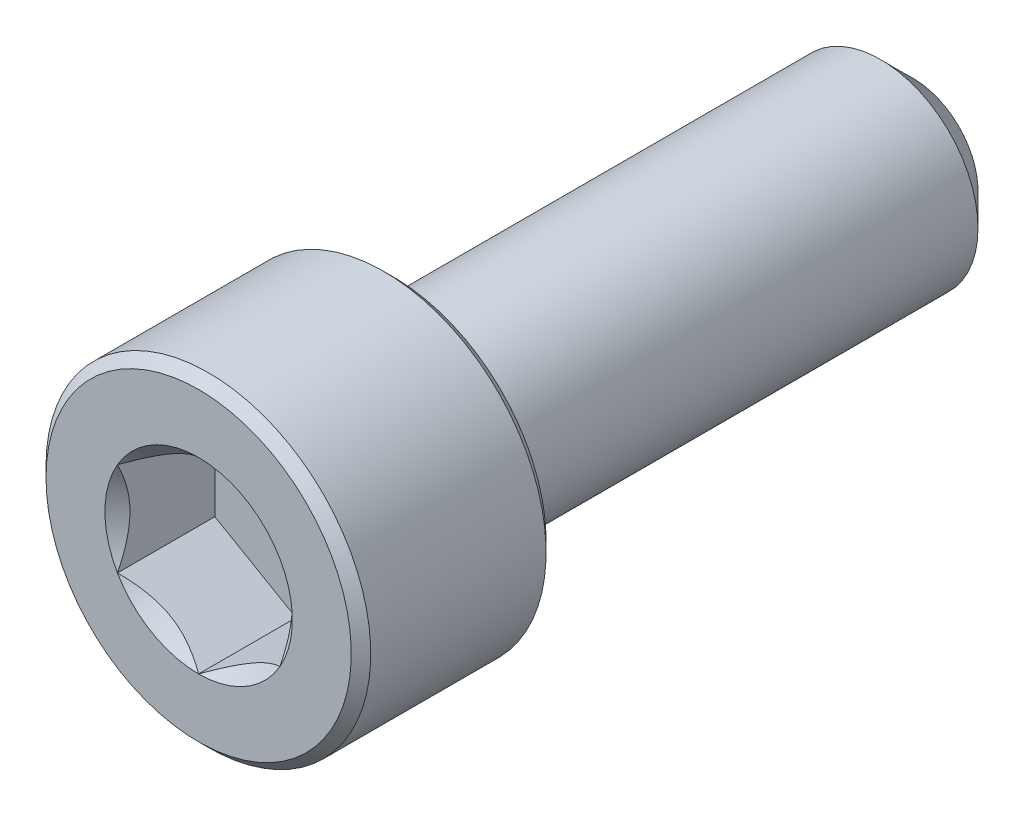
ISO-10303-21;
HEADER;
FILE_DESCRIPTION(('STEP AP214'),'2;1');
FILE_NAME('part.step','',(''),(''),'','','');
FILE_SCHEMA(('AUTOMOTIVE_DESIGN { 1 0 10303 214 1 1 1 1 }'));
ENDSEC;
DATA;
#1=APPLICATION_CONTEXT('core data for automotive mechanical design processes');
#2=APPLICATION_PROTOCOL_DEFINITION('international standard','automotive_design',2000,#1);
#3=PRODUCT_CONTEXT('',#1,'mechanical');
#4=PRODUCT('Part','Part','',(#3));
#5=PRODUCT_RELATED_PRODUCT_CATEGORY('part','',(#4));
#6=PRODUCT_DEFINITION_FORMATION('','',#4);
#7=PRODUCT_DEFINITION_CONTEXT('part definition',#1,'design');
#8=PRODUCT_DEFINITION('design','',#6,#7);
#9=PRODUCT_DEFINITION_SHAPE('','',#8);
#10=(LENGTH_UNIT() NAMED_UNIT(*) SI_UNIT(.MILLI.,.METRE.));
#11=(NAMED_UNIT(*) PLANE_ANGLE_UNIT() SI_UNIT($,.RADIAN.));
#12=(NAMED_UNIT(*) SI_UNIT($,.STERADIAN.) SOLID_ANGLE_UNIT());
#13=UNCERTAINTY_MEASURE_WITH_UNIT(LENGTH_MEASURE(1.E-05),#10,'distance_accuracy_value','');
#14=(GEOMETRIC_REPRESENTATION_CONTEXT(3) GLOBAL_UNCERTAINTY_ASSIGNED_CONTEXT((#13)) GLOBAL_UNIT_ASSIGNED_CONTEXT((#10,
#11,#12)) REPRESENTATION_CONTEXT('',''));
#15=CARTESIAN_POINT('',(0.,0.,0.));
#16=DIRECTION('',(0.,0.,1.));
#17=DIRECTION('',(1.,0.,0.));
#18=AXIS2_PLACEMENT_3D('',#15,#16,#17);
#19=CARTESIAN_POINT('',(0.,4.7,11.));
#20=DIRECTION('',(0.,0.,1.));
#21=DIRECTION('',(1.,0.,0.));
#22=AXIS2_PLACEMENT_3D('',#19,#20,#21);
#23=PLANE('',#22);
#24=CARTESIAN_POINT('',(0.,0.,11.));
#25=DIRECTION('',(0.,0.,1.));
#26=DIRECTION('',(1.,0.,0.));
#27=AXIS2_PLACEMENT_3D('',#24,#25,#26);
#28=CIRCLE('',#27,2.88675134594813);
#29=CARTESIAN_POINT('',(2.5,1.44337567297407,11.));
#30=VERTEX_POINT('',#29);
#31=CARTESIAN_POINT('',(0.,2.88675134594813,11.));
#32=VERTEX_POINT('',#31);
#33=EDGE_CURVE('E98',#30,#32,#28,.T.);
#34=ORIENTED_EDGE('',*,*,#33,.F.);
#35=CARTESIAN_POINT('',(2.5,-1.44337567297407,11.));
#36=VERTEX_POINT('',#35);
#37=EDGE_CURVE('E58',#36,#30,#28,.T.);
#38=ORIENTED_EDGE('',*,*,#37,.F.);
#39=CARTESIAN_POINT('',(0.,-2.88675134594813,11.));
#40=VERTEX_POINT('',#39);
#41=EDGE_CURVE('E284',#40,#36,#28,.T.);
#42=ORIENTED_EDGE('',*,*,#41,.F.);
#43=CARTESIAN_POINT('',(-2.5,-1.44337567297406,11.));
#44=VERTEX_POINT('',#43);
#45=EDGE_CURVE('E65',#44,#40,#28,.T.);
#46=ORIENTED_EDGE('',*,*,#45,.F.);
#47=CARTESIAN_POINT('',(-2.5,1.44337567297407,11.));
#48=VERTEX_POINT('',#47);
#49=EDGE_CURVE('E134',#48,#44,#28,.T.);
#50=ORIENTED_EDGE('',*,*,#49,.F.);
#51=EDGE_CURVE('E107',#32,#48,#28,.T.);
#52=ORIENTED_EDGE('',*,*,#51,.F.);
#53=EDGE_LOOP('',(#34,#38,#42,#46,#50,#52));
#54=FACE_BOUND('',#53,.T.);
#55=CARTESIAN_POINT('',(0.,0.,11.));
#56=DIRECTION('',(0.,0.,-1.));
#57=DIRECTION('',(-1.,0.,0.));
#58=AXIS2_PLACEMENT_3D('',#55,#56,#57);
#59=CIRCLE('',#58,4.7);
#60=CARTESIAN_POINT('',(-4.7,0.,11.));
#61=VERTEX_POINT('',#60);
#62=EDGE_CURVE('E52',#61,#61,#59,.T.);
#63=ORIENTED_EDGE('',*,*,#62,.F.);
#64=EDGE_LOOP('',(#63));
#65=FACE_BOUND('',#64,.T.);
#66=ADVANCED_FACE('F39',(#54,#65),#23,.T.);
#67=CARTESIAN_POINT('',(0.,0.,10.7));
#68=DIRECTION('',(0.,0.,-1.));
#69=DIRECTION('',(-1.,0.,0.));
#70=AXIS2_PLACEMENT_3D('',#67,#68,#69);
#71=CONICAL_SURFACE('',#70,5.,0.785398163397445);
#72=ORIENTED_EDGE('',*,*,#62,.T.);
#73=EDGE_LOOP('',(#72));
#74=FACE_BOUND('',#73,.T.);
#75=CARTESIAN_POINT('',(0.,0.,10.7));
#76=DIRECTION('',(0.,0.,-1.));
#77=DIRECTION('',(-1.,0.,0.));
#78=AXIS2_PLACEMENT_3D('',#75,#76,#77);
#79=CIRCLE('',#78,5.);
#80=CARTESIAN_POINT('',(-5.,0.,10.7));
#81=VERTEX_POINT('',#80);
#82=EDGE_CURVE('E218',#81,#81,#79,.T.);
#83=ORIENTED_EDGE('',*,*,#82,.F.);
#84=EDGE_LOOP('',(#83));
#85=FACE_BOUND('',#84,.T.);
#86=ADVANCED_FACE('F223',(#74,#85),#71,.T.);
#87=CARTESIAN_POINT('',(0.,0.,-11.));
#88=DIRECTION('',(0.,0.,-1.));
#89=DIRECTION('',(-1.,0.,0.));
#90=AXIS2_PLACEMENT_3D('',#87,#88,#89);
#91=CYLINDRICAL_SURFACE('',#90,5.);
#92=ORIENTED_EDGE('',*,*,#82,.T.);
#93=EDGE_LOOP('',(#92));
#94=FACE_BOUND('',#93,.T.);
#95=CARTESIAN_POINT('',(0.,0.,5.3));
#96=DIRECTION('',(0.,0.,-1.));
#97=DIRECTION('',(-1.,0.,0.));
#98=AXIS2_PLACEMENT_3D('',#95,#96,#97);
#99=CIRCLE('',#98,5.);
#100=CARTESIAN_POINT('',(-5.,0.,5.3));
#101=VERTEX_POINT('',#100);
#102=EDGE_CURVE('E215',#101,#101,#99,.T.);
#103=ORIENTED_EDGE('',*,*,#102,.F.);
#104=EDGE_LOOP('',(#103));
#105=FACE_BOUND('',#104,.T.);
#106=ADVANCED_FACE('F229',(#94,#105),#91,.T.);
#107=CARTESIAN_POINT('',(0.,0.,5.));
#108=DIRECTION('',(0.,0.,1.));
#109=DIRECTION('',(1.,0.,0.));
#110=AXIS2_PLACEMENT_3D('',#107,#108,#109);
#111=CONICAL_SURFACE('',#110,4.7,0.785398163397454);
#112=ORIENTED_EDGE('',*,*,#102,.T.);
#113=EDGE_LOOP('',(#112));
#114=FACE_BOUND('',#113,.T.);
#115=CARTESIAN_POINT('',(0.,0.,5.));
#116=DIRECTION('',(0.,0.,-1.));
#117=DIRECTION('',(-1.,0.,0.));
#118=AXIS2_PLACEMENT_3D('',#115,#116,#117);
#119=CIRCLE('',#118,4.7);
#120=CARTESIAN_POINT('',(-4.7,0.,5.));
#121=VERTEX_POINT('',#120);
#122=EDGE_CURVE('E212',#121,#121,#119,.T.);
#123=ORIENTED_EDGE('',*,*,#122,.F.);
#124=EDGE_LOOP('',(#123));
#125=FACE_BOUND('',#124,.T.);
#126=ADVANCED_FACE('F233',(#114,#125),#111,.T.);
#127=CARTESIAN_POINT('',(0.,4.7,5.));
#128=DIRECTION('',(0.,0.,-1.));
#129=DIRECTION('',(-1.,0.,0.));
#130=AXIS2_PLACEMENT_3D('',#127,#128,#129);
#131=PLANE('',#130);
#132=ORIENTED_EDGE('',*,*,#122,.T.);
#133=EDGE_LOOP('',(#132));
#134=FACE_BOUND('',#133,.T.);
#135=CARTESIAN_POINT('',(0.,0.,5.));
#136=DIRECTION('',(0.,0.,-1.));
#137=DIRECTION('',(-1.,0.,0.));
#138=AXIS2_PLACEMENT_3D('',#135,#136,#137);
#139=CIRCLE('',#138,3.);
#140=CARTESIAN_POINT('',(-3.,0.,5.));
#141=VERTEX_POINT('',#140);
#142=EDGE_CURVE('E209',#141,#141,#139,.T.);
#143=ORIENTED_EDGE('',*,*,#142,.F.);
#144=EDGE_LOOP('',(#143));
#145=FACE_BOUND('',#144,.T.);
#146=ADVANCED_FACE('F239',(#134,#145),#131,.T.);
#147=CARTESIAN_POINT('',(0.,0.,-11.));
#148=DIRECTION('',(0.,0.,-1.));
#149=DIRECTION('',(-1.,0.,0.));
#150=AXIS2_PLACEMENT_3D('',#147,#148,#149);
#151=CYLINDRICAL_SURFACE('',#150,3.);
#152=ORIENTED_EDGE('',*,*,#142,.T.);
#153=EDGE_LOOP('',(#152));
#154=FACE_BOUND('',#153,.T.);
#155=CARTESIAN_POINT('',(0.,0.,-9.99999999999999));
#156=DIRECTION('',(0.,0.,-1.));
#157=DIRECTION('',(-1.,0.,0.));
#158=AXIS2_PLACEMENT_3D('',#155,#156,#157);
#159=CIRCLE('',#158,3.);
#160=CARTESIAN_POINT('',(-3.,0.,-9.99999999999999));
#161=VERTEX_POINT('',#160);
#162=EDGE_CURVE('E206',#161,#161,#159,.T.);
#163=ORIENTED_EDGE('',*,*,#162,.F.);
#164=EDGE_LOOP('',(#163));
#165=FACE_BOUND('',#164,.T.);
#166=ADVANCED_FACE('F243',(#154,#165),#151,.T.);
#167=CARTESIAN_POINT('',(0.,0.,-11.));
#168=DIRECTION('',(0.,0.,1.));
#169=DIRECTION('',(1.,0.,0.));
#170=AXIS2_PLACEMENT_3D('',#167,#168,#169);
#171=CONICAL_SURFACE('',#170,2.,0.785398163397443);
#172=ORIENTED_EDGE('',*,*,#162,.T.);
#173=EDGE_LOOP('',(#172));
#174=FACE_BOUND('',#173,.T.);
#175=CARTESIAN_POINT('',(0.,0.,-11.));
#176=DIRECTION('',(0.,0.,-1.));
#177=DIRECTION('',(-1.,0.,0.));
#178=AXIS2_PLACEMENT_3D('',#175,#176,#177);
#179=CIRCLE('',#178,2.);
#180=CARTESIAN_POINT('',(-2.,0.,-11.));
#181=VERTEX_POINT('',#180);
#182=EDGE_CURVE('E194',#181,#181,#179,.T.);
#183=ORIENTED_EDGE('',*,*,#182,.F.);
#184=EDGE_LOOP('',(#183));
#185=FACE_BOUND('',#184,.T.);
#186=ADVANCED_FACE('F246',(#174,#185),#171,.T.);
#187=CARTESIAN_POINT('',(0.,2.,-11.));
#188=DIRECTION('',(0.,0.,-1.));
#189=DIRECTION('',(-1.,0.,0.));
#190=AXIS2_PLACEMENT_3D('',#187,#188,#189);
#191=PLANE('',#190);
#192=ORIENTED_EDGE('',*,*,#182,.T.);
#193=EDGE_LOOP('',(#192));
#194=FACE_BOUND('',#193,.T.);
#195=ADVANCED_FACE('F167',(#194),#191,.T.);
#196=CARTESIAN_POINT('',(0.,0.,11.));
#197=DIRECTION('',(0.,0.,1.));
#198=DIRECTION('',(1.,0.,0.));
#199=AXIS2_PLACEMENT_3D('',#196,#197,#198);
#200=CONICAL_SURFACE('',#199,2.88675134594813,0.78539816339745);
#201=ORIENTED_EDGE('',*,*,#51,.T.);
#202=CARTESIAN_POINT('',(0.00020000000000054,2.88686681600197,11.0001154769818));
#203=CARTESIAN_POINT('',(-0.0857382777877643,2.83725032818751,10.9505407053547));
#204=CARTESIAN_POINT('',(-0.173113567275753,2.7868041812811,10.9038774813625));
#205=CARTESIAN_POINT('',(-0.351281456165588,2.6839389026696,10.8184381400383));
#206=CARTESIAN_POINT('',(-0.442091000681074,2.6315099876986,10.779709562406));
#207=CARTESIAN_POINT('',(-0.625204123126921,2.52578957716234,10.7133667038977));
#208=CARTESIAN_POINT('',(-0.71746106452934,2.47252500720904,10.6855856685309));
#209=CARTESIAN_POINT('',(-0.904006008776286,2.3648232334321,10.6427831759107));
#210=CARTESIAN_POINT('',(-0.998288312566283,2.31038931995913,10.6277297666713));
#211=CARTESIAN_POINT('',(-1.16077825829185,2.21657570605387,10.6141477222095));
#212=CARTESIAN_POINT('',(-1.22877596788015,2.17731721011878,10.6121370992408));
#213=CARTESIAN_POINT('',(-1.36466024116922,2.0988643883567,10.6155241171875));
#214=CARTESIAN_POINT('',(-1.43254675755224,2.05967008984862,10.6209243552998));
#215=CARTESIAN_POINT('',(-1.56767878823611,1.98165157555715,10.6388257884025));
#216=CARTESIAN_POINT('',(-1.63492349975356,1.94282782326097,10.6513349270465));
#217=CARTESIAN_POINT('',(-1.7682501008182,1.86585167424616,10.6827675019557));
#218=CARTESIAN_POINT('',(-1.83433207909966,1.82769922629678,10.7016904464968));
#219=CARTESIAN_POINT('',(-2.00359634669126,1.72997445583858,10.7578673614082));
#220=CARTESIAN_POINT('',(-2.10572912222289,1.67100807039231,10.7993558315962));
#221=CARTESIAN_POINT('',(-2.25590641494051,1.58430317001562,10.8693940467231));
#222=CARTESIAN_POINT('',(-2.30539653988261,1.55573003305807,10.8940022521161));
#223=CARTESIAN_POINT('',(-2.40346006383885,1.49911303110426,10.9454618867152));
#224=CARTESIAN_POINT('',(-2.45203400349693,1.47106885396706,10.9723119387794));
#225=CARTESIAN_POINT('',(-2.5002,1.44326020292023,11.0001154769818));
#226=B_SPLINE_CURVE_WITH_KNOTS('',3,(#202,#203,#204,#205,#206,#207,#208,#209,#210,#211,#212,
#213,#214,#215,#216,#217,#218,#219,#220,#221,#222,#223,#224,#225),.UNSPECIFIED.,.F.,.F.,(4,2,2,
2,2,2,2,2,2,2,2,4),(0.,0.333012085133924,0.667964518301397,0.997597032043299,1.32639954393844,
1.56169424147169,1.79707142102083,2.03271213522171,2.26833478775651,2.64260240809533,
2.82922877818864,3.01574133749025),.UNSPECIFIED.);
#227=EDGE_CURVE('E11',#32,#48,#226,.T.);
#228=ORIENTED_EDGE('',*,*,#227,.F.);
#229=EDGE_LOOP('',(#201,#228));
#230=FACE_BOUND('',#229,.T.);
#231=ADVANCED_FACE('F111',(#230),#200,.F.);
#232=ORIENTED_EDGE('',*,*,#49,.T.);
#233=CARTESIAN_POINT('',(-2.5,-2.96668433955212,11.9928383192799));
#234=CARTESIAN_POINT('',(-2.5,-2.89483170967249,11.9379057089797));
#235=CARTESIAN_POINT('',(-2.5,-2.82258679707705,11.883478050823));
#236=CARTESIAN_POINT('',(-2.5,-2.67715393829105,11.7758617915343));
#237=CARTESIAN_POINT('',(-2.5,-2.60396576868743,11.7226734926472));
#238=CARTESIAN_POINT('',(-2.5,-2.45595268046653,11.6173865397426));
#239=CARTESIAN_POINT('',(-2.5,-2.38111948346966,11.5652994850005));
#240=CARTESIAN_POINT('',(-2.5,-2.23019896534479,11.4629812536341));
#241=CARTESIAN_POINT('',(-2.5,-2.15411173180743,11.4127499481792));
#242=CARTESIAN_POINT('',(-2.5,-1.99575761371829,11.311547152196));
#243=CARTESIAN_POINT('',(-2.5,-1.91339821044008,11.2607196975498));
#244=CARTESIAN_POINT('',(-2.5,-1.74677292530007,11.1622970160088));
#245=CARTESIAN_POINT('',(-2.5,-1.6625072948511,11.1147013661458));
#246=CARTESIAN_POINT('',(-2.5,-1.49202090628761,11.0237370895292));
#247=CARTESIAN_POINT('',(-2.5,-1.4058065139511,10.9803566253319));
#248=CARTESIAN_POINT('',(-2.5,-1.23096887512707,10.8988023964179));
#249=CARTESIAN_POINT('',(-2.5,-1.14234677306193,10.8606262082116));
#250=CARTESIAN_POINT('',(-2.5,-0.970857842618475,10.7940912240297));
#251=CARTESIAN_POINT('',(-2.5,-0.88821917035142,10.7651503854592));
#252=CARTESIAN_POINT('',(-2.5,-0.72087529812657,10.7138877367376));
#253=CARTESIAN_POINT('',(-2.5,-0.636169963529765,10.6915663590842));
#254=CARTESIAN_POINT('',(-2.5,-0.466650942448522,10.6551078210399));
#255=CARTESIAN_POINT('',(-2.5,-0.381869134653475,10.640824902214));
#256=CARTESIAN_POINT('',(-2.5,-0.21130174226405,10.6207346384147));
#257=CARTESIAN_POINT('',(-2.5,-0.125516356521813,10.6149256421311));
#258=CARTESIAN_POINT('',(-2.5,0.0426703656744088,10.6122567453414));
#259=CARTESIAN_POINT('',(-2.5,0.125066107632579,10.6150393831091));
#260=CARTESIAN_POINT('',(-2.5,0.289193381610074,10.6285896677016));
#261=CARTESIAN_POINT('',(-2.5,0.370924851074764,10.6393580579361));
#262=CARTESIAN_POINT('',(-2.5,0.534518605306861,10.668460488394));
#263=CARTESIAN_POINT('',(-2.5,0.616357066153053,10.6869264467587));
#264=CARTESIAN_POINT('',(-2.5,0.778230408567295,10.7304160931401));
#265=CARTESIAN_POINT('',(-2.5,0.858265409015189,10.7554393475341));
#266=CARTESIAN_POINT('',(-2.5,1.1064014205137,10.8425323271403));
#267=CARTESIAN_POINT('',(-2.5,1.27108970475709,10.9143583169891));
#268=CARTESIAN_POINT('',(-2.5,1.51211013995078,11.0341428940312));
#269=CARTESIAN_POINT('',(-2.5,1.59159684007468,11.0761721404265));
#270=CARTESIAN_POINT('',(-2.5,1.74876895904321,11.1634810506814));
#271=CARTESIAN_POINT('',(-2.5,1.82645469386738,11.2087601385578));
#272=CARTESIAN_POINT('',(-2.5,1.97643122124165,11.2996104452916));
#273=CARTESIAN_POINT('',(-2.5,2.04879877304287,11.3450563815238));
#274=CARTESIAN_POINT('',(-2.5,2.19229239644038,11.4378770245958));
#275=CARTESIAN_POINT('',(-2.5,2.2634183740633,11.4852518765365));
#276=CARTESIAN_POINT('',(-2.5,2.4040160675888,11.5811974908952));
#277=CARTESIAN_POINT('',(-2.5,2.47349649538701,11.6297555399303));
#278=CARTESIAN_POINT('',(-2.5,2.61150521882323,11.7281681623755));
#279=CARTESIAN_POINT('',(-2.5,2.68003377150943,11.7780223748942));
#280=CARTESIAN_POINT('',(-2.5,2.74816343524431,11.8284070984273));
#281=B_SPLINE_CURVE_WITH_KNOTS('',3,(#233,#234,#235,#236,#237,#238,#239,#240,#241,#242,#243,
#244,#245,#246,#247,#248,#249,#250,#251,#252,#253,#254,#255,#256,#257,#258,#259,#260,#261,#262,
#263,#264,#265,#266,#267,#268,#269,#270,#271,#272,#273,#274,#275,#276,#277,#278,#279,#280),
.UNSPECIFIED.,.F.,.F.,(4,2,2,2,2,2,2,2,2,2,2,2,2,2,2,2,2,2,2,2,2,2,2,4),(0.,0.271341667855832,
0.542748830046722,0.816253709161613,1.08973956507594,1.38002315639178,1.67026868280412,
1.959674013636,2.24894411253435,2.51139576932094,2.77386457021756,3.0314066607157,
3.28889855737335,3.53582375183444,3.78277193594475,4.03413854269895,4.28548853120069,
4.82282938730673,5.09254998785807,5.36222290216636,5.61855395261544,5.87490432107987,
6.12918893681205,6.38340349453406),.UNSPECIFIED.);
#282=EDGE_CURVE('E106',#48,#44,#281,.F.);
#283=ORIENTED_EDGE('',*,*,#282,.F.);
#284=EDGE_LOOP('',(#232,#283));
#285=FACE_BOUND('',#284,.T.);
#286=ADVANCED_FACE('F261',(#285),#200,.F.);
#287=ORIENTED_EDGE('',*,*,#45,.T.);
#288=CARTESIAN_POINT('',(-2.5002,-1.44326020292023,11.0001154769818));
#289=CARTESIAN_POINT('',(-2.41426172221224,-1.49287669073469,10.9505407053547));
#290=CARTESIAN_POINT('',(-2.32688643272425,-1.5433228376411,10.9038774813625));
#291=CARTESIAN_POINT('',(-2.14871854383441,-1.64618811625259,10.8184381400383));
#292=CARTESIAN_POINT('',(-2.05790899931893,-1.69861703122359,10.779709562406));
#293=CARTESIAN_POINT('',(-1.87479587687308,-1.80433744175986,10.7133667038977));
#294=CARTESIAN_POINT('',(-1.78253893547066,-1.85760201171315,10.6855856685309));
#295=CARTESIAN_POINT('',(-1.59599399122372,-1.96530378549009,10.6427831759107));
#296=CARTESIAN_POINT('',(-1.50171168743372,-2.01973769896307,10.6277297666713));
#297=CARTESIAN_POINT('',(-1.33922174170816,-2.11355131286833,10.6141477222095));
#298=CARTESIAN_POINT('',(-1.27122403211985,-2.15280980880341,10.6121370992408));
#299=CARTESIAN_POINT('',(-1.13533975883078,-2.23126263056549,10.6155241171875));
#300=CARTESIAN_POINT('',(-1.06745324244776,-2.27045692907358,10.6209243552998));
#301=CARTESIAN_POINT('',(-0.932321211763895,-2.34847544336505,10.6388257884025));
#302=CARTESIAN_POINT('',(-0.865076500246441,-2.38729919566123,10.6513349270465));
#303=CARTESIAN_POINT('',(-0.731749899181802,-2.46427534467604,10.6827675019557));
#304=CARTESIAN_POINT('',(-0.665667920900344,-2.50242779262542,10.7016904464968));
#305=CARTESIAN_POINT('',(-0.496403653308736,-2.60015256308362,10.7578673614082));
#306=CARTESIAN_POINT('',(-0.394270877777108,-2.65911894852989,10.7993558315962));
#307=CARTESIAN_POINT('',(-0.244093585059492,-2.74582384890657,10.8693940467231));
#308=CARTESIAN_POINT('',(-0.194603460117392,-2.77439698586412,10.8940022521161));
#309=CARTESIAN_POINT('',(-0.0965399361611542,-2.83101398781794,10.9454618867152));
#310=CARTESIAN_POINT('',(-0.047965996503073,-2.85905816495513,10.9723119387794));
#311=CARTESIAN_POINT('',(0.000199999999999232,-2.88686681600197,11.0001154769818));
#312=B_SPLINE_CURVE_WITH_KNOTS('',3,(#288,#289,#290,#291,#292,#293,#294,#295,#296,#297,#298,
#299,#300,#301,#302,#303,#304,#305,#306,#307,#308,#309,#310,#311),.UNSPECIFIED.,.F.,.F.,(4,2,2,
2,2,2,2,2,2,2,2,4),(0.,0.333012085133923,0.667964518301397,0.997597032043299,1.32639954393844,
1.56169424147169,1.79707142102083,2.03271213522171,2.26833478775651,2.64260240809533,
2.82922877818864,3.01574133749025),.UNSPECIFIED.);
#313=EDGE_CURVE('E143',#44,#40,#312,.T.);
#314=ORIENTED_EDGE('',*,*,#313,.F.);
#315=EDGE_LOOP('',(#287,#314));
#316=FACE_BOUND('',#315,.T.);
#317=ADVANCED_FACE('F265',(#316),#200,.F.);
#318=ORIENTED_EDGE('',*,*,#41,.T.);
#319=CARTESIAN_POINT('',(-0.000200000000000439,-2.88686681600197,11.0001154769818));
#320=CARTESIAN_POINT('',(0.0857382777877645,-2.83725032818751,10.9505407053547));
#321=CARTESIAN_POINT('',(0.173113567275753,-2.7868041812811,10.9038774813625));
#322=CARTESIAN_POINT('',(0.351281456165588,-2.6839389026696,10.8184381400383));
#323=CARTESIAN_POINT('',(0.442091000681074,-2.6315099876986,10.779709562406));
#324=CARTESIAN_POINT('',(0.62520412312692,-2.52578957716234,10.7133667038977));
#325=CARTESIAN_POINT('',(0.71746106452934,-2.47252500720904,10.6855856685309));
#326=CARTESIAN_POINT('',(0.904006008776285,-2.3648232334321,10.6427831759107));
#327=CARTESIAN_POINT('',(0.998288312566282,-2.31038931995913,10.6277297666713));
#328=CARTESIAN_POINT('',(1.16077825829184,-2.21657570605387,10.6141477222095));
#329=CARTESIAN_POINT('',(1.22877596788015,-2.17731721011878,10.6121370992408));
#330=CARTESIAN_POINT('',(1.36466024116922,-2.0988643883567,10.6155241171875));
#331=CARTESIAN_POINT('',(1.43254675755224,-2.05967008984862,10.6209243552998));
#332=CARTESIAN_POINT('',(1.5676787882361,-1.98165157555715,10.6388257884025));
#333=CARTESIAN_POINT('',(1.63492349975356,-1.94282782326097,10.6513349270465));
#334=CARTESIAN_POINT('',(1.7682501008182,-1.86585167424616,10.6827675019557));
#335=CARTESIAN_POINT('',(1.83433207909966,-1.82769922629678,10.7016904464968));
#336=CARTESIAN_POINT('',(2.00359634669126,-1.72997445583858,10.7578673614082));
#337=CARTESIAN_POINT('',(2.10572912222289,-1.67100807039231,10.7993558315962));
#338=CARTESIAN_POINT('',(2.25590641494051,-1.58430317001562,10.8693940467231));
#339=CARTESIAN_POINT('',(2.30539653988261,-1.55573003305807,10.8940022521161));
#340=CARTESIAN_POINT('',(2.40346006383885,-1.49911303110426,10.9454618867152));
#341=CARTESIAN_POINT('',(2.45203400349693,-1.47106885396706,10.9723119387794));
#342=CARTESIAN_POINT('',(2.5002,-1.44326020292023,11.0001154769818));
#343=B_SPLINE_CURVE_WITH_KNOTS('',3,(#319,#320,#321,#322,#323,#324,#325,#326,#327,#328,#329,
#330,#331,#332,#333,#334,#335,#336,#337,#338,#339,#340,#341,#342),.UNSPECIFIED.,.F.,.F.,(4,2,2,
2,2,2,2,2,2,2,2,4),(0.,0.333012085133923,0.667964518301396,0.997597032043298,1.32639954393844,
1.56169424147168,1.79707142102083,2.0327121352217,2.2683347877565,2.64260240809533,
2.82922877818864,3.01574133749025),.UNSPECIFIED.);
#344=EDGE_CURVE('E286',#40,#36,#343,.T.);
#345=ORIENTED_EDGE('',*,*,#344,.F.);
#346=EDGE_LOOP('',(#318,#345));
#347=FACE_BOUND('',#346,.T.);
#348=ADVANCED_FACE('F274',(#347),#200,.F.);
#349=ORIENTED_EDGE('',*,*,#37,.T.);
#350=CARTESIAN_POINT('',(2.5,-2.96668433956992,11.9928383192935));
#351=CARTESIAN_POINT('',(2.5,-2.89483170968978,11.9379057089928));
#352=CARTESIAN_POINT('',(2.5,-2.82258679709383,11.8834780508356));
#353=CARTESIAN_POINT('',(2.5,-2.6771539383068,11.7758617915458));
#354=CARTESIAN_POINT('',(2.5,-2.60396576870266,11.7226734926582));
#355=CARTESIAN_POINT('',(2.5,-2.45595268048071,11.6173865397526));
#356=CARTESIAN_POINT('',(2.5,-2.38111948348331,11.5652994850099));
#357=CARTESIAN_POINT('',(2.5,-2.23019896535737,11.4629812536425));
#358=CARTESIAN_POINT('',(2.5,-2.15411173181947,11.4127499481871));
#359=CARTESIAN_POINT('',(2.5,-1.99575761372916,11.3115471522028));
#360=CARTESIAN_POINT('',(2.5,-1.91339821045031,11.260719697556));
#361=CARTESIAN_POINT('',(2.5,-1.74677292530902,11.1622970160139));
#362=CARTESIAN_POINT('',(2.5,-1.6625072948594,11.1147013661504));
#363=CARTESIAN_POINT('',(2.5,-1.49202090629459,11.0237370895328));
#364=CARTESIAN_POINT('',(2.5,-1.4058065139574,10.980356625335));
#365=CARTESIAN_POINT('',(2.5,-1.23096887513198,10.8988023964201));
#366=CARTESIAN_POINT('',(2.5,-1.14234677306614,10.8606262082134));
#367=CARTESIAN_POINT('',(2.5,-0.970857842622378,10.7940912240311));
#368=CARTESIAN_POINT('',(2.5,-0.888219170355766,10.7651503854607));
#369=CARTESIAN_POINT('',(2.5,-0.720875298131817,10.713887736739));
#370=CARTESIAN_POINT('',(2.5,-0.636169963535471,10.6915663590856));
#371=CARTESIAN_POINT('',(2.5,-0.466650942455131,10.6551078210411));
#372=CARTESIAN_POINT('',(2.5,-0.381869134660527,10.6408249022151));
#373=CARTESIAN_POINT('',(2.5,-0.211301742271978,10.6207346384154));
#374=CARTESIAN_POINT('',(2.5,-0.125516356530172,10.6149256421315));
#375=CARTESIAN_POINT('',(2.5,0.0426703656652953,10.6122567453413));
#376=CARTESIAN_POINT('',(2.5,0.125066107623141,10.6150393831087));
#377=CARTESIAN_POINT('',(2.5,0.289193381600021,10.6285896677004));
#378=CARTESIAN_POINT('',(2.5,0.370924851064421,10.6393580579346));
#379=CARTESIAN_POINT('',(2.5,0.534518605295946,10.6684604883917));
#380=CARTESIAN_POINT('',(2.5,0.616357066141858,10.686926446756));
#381=CARTESIAN_POINT('',(2.5,0.778230408555566,10.7304160931367));
#382=CARTESIAN_POINT('',(2.5,0.858265409003208,10.7554393475302));
#383=CARTESIAN_POINT('',(2.5,1.10640142049915,10.8425323271345));
#384=CARTESIAN_POINT('',(2.5,1.27108970474035,10.9143583169815));
#385=CARTESIAN_POINT('',(2.5,1.5121101399309,11.034142894021));
#386=CARTESIAN_POINT('',(2.5,1.59159684005377,11.0761721404153));
#387=CARTESIAN_POINT('',(2.5,1.74876895902027,11.1634810506683));
#388=CARTESIAN_POINT('',(2.5,1.82645469384344,11.2087601385437));
#389=CARTESIAN_POINT('',(2.5,1.9764312212159,11.2996104452756));
#390=CARTESIAN_POINT('',(2.5,2.0487987730163,11.345056381507));
#391=CARTESIAN_POINT('',(2.5,2.19229239641219,11.4378770245772));
#392=CARTESIAN_POINT('',(2.5,2.26341837403431,11.485251876517));
#393=CARTESIAN_POINT('',(2.5,2.40401606755821,11.581197490874));
#394=CARTESIAN_POINT('',(2.5,2.47349649535563,11.6297555399082));
#395=CARTESIAN_POINT('',(2.5,2.61150521879029,11.7281681623517));
#396=CARTESIAN_POINT('',(2.5,2.68003377147571,11.7780223748695));
#397=CARTESIAN_POINT('',(2.5,2.74816343520981,11.8284070984017));
#398=B_SPLINE_CURVE_WITH_KNOTS('',3,(#350,#351,#352,#353,#354,#355,#356,#357,#358,#359,#360,
#361,#362,#363,#364,#365,#366,#367,#368,#369,#370,#371,#372,#373,#374,#375,#376,#377,#378,#379,
#380,#381,#382,#383,#384,#385,#386,#387,#388,#389,#390,#391,#392,#393,#394,#395,#396,#397),
.UNSPECIFIED.,.F.,.F.,(4,2,2,2,2,2,2,2,2,2,2,2,2,2,2,2,2,2,2,2,2,2,2,4),(0.,0.271341667858005,
0.542748830051066,0.816253709168171,1.08973956508472,1.38002315640304,1.67026868281787,
1.95967401365221,2.24894411255303,2.51139576933832,2.77386457023366,3.03140666073056,
3.28889855738698,3.53582375184707,3.78277193595638,4.03413854270949,4.28548853121014,
4.82282938730813,5.0925499878554,5.36222290215963,5.61855395260525,5.87490432106622,
6.12918893679497,6.38340349451356),.UNSPECIFIED.);
#399=EDGE_CURVE('E123',#36,#30,#398,.T.);
#400=ORIENTED_EDGE('',*,*,#399,.F.);
#401=EDGE_LOOP('',(#349,#400));
#402=FACE_BOUND('',#401,.T.);
#403=ADVANCED_FACE('F268',(#402),#200,.F.);
#404=ORIENTED_EDGE('',*,*,#33,.T.);
#405=CARTESIAN_POINT('',(2.5002,1.44326020292023,11.0001154769818));
#406=CARTESIAN_POINT('',(2.41426172221224,1.49287669073469,10.9505407053547));
#407=CARTESIAN_POINT('',(2.32688643272425,1.5433228376411,10.9038774813625));
#408=CARTESIAN_POINT('',(2.14871854383441,1.64618811625259,10.8184381400383));
#409=CARTESIAN_POINT('',(2.05790899931893,1.69861703122359,10.779709562406));
#410=CARTESIAN_POINT('',(1.87479587687308,1.80433744175986,10.7133667038977));
#411=CARTESIAN_POINT('',(1.78253893547066,1.85760201171316,10.6855856685309));
#412=CARTESIAN_POINT('',(1.59599399122372,1.96530378549009,10.6427831759107));
#413=CARTESIAN_POINT('',(1.50171168743372,2.01973769896307,10.6277297666713));
#414=CARTESIAN_POINT('',(1.33922174170816,2.11355131286833,10.6141477222095));
#415=CARTESIAN_POINT('',(1.27122403211985,2.15280980880341,10.6121370992408));
#416=CARTESIAN_POINT('',(1.13533975883078,2.23126263056549,10.6155241171875));
#417=CARTESIAN_POINT('',(1.06745324244776,2.27045692907358,10.6209243552998));
#418=CARTESIAN_POINT('',(0.932321211763896,2.34847544336505,10.6388257884025));
#419=CARTESIAN_POINT('',(0.865076500246442,2.38729919566123,10.6513349270465));
#420=CARTESIAN_POINT('',(0.731749899181803,2.46427534467604,10.6827675019557));
#421=CARTESIAN_POINT('',(0.665667920900345,2.50242779262542,10.7016904464968));
#422=CARTESIAN_POINT('',(0.496403653308737,2.60015256308362,10.7578673614082));
#423=CARTESIAN_POINT('',(0.394270877777108,2.65911894852989,10.7993558315962));
#424=CARTESIAN_POINT('',(0.244093585059493,2.74582384890657,10.8693940467231));
#425=CARTESIAN_POINT('',(0.194603460117392,2.77439698586412,10.8940022521161));
#426=CARTESIAN_POINT('',(0.0965399361611546,2.83101398781794,10.9454618867152));
#427=CARTESIAN_POINT('',(0.0479659965030731,2.85905816495513,10.9723119387794));
#428=CARTESIAN_POINT('',(-0.000199999999999843,2.88686681600197,11.0001154769818));
#429=B_SPLINE_CURVE_WITH_KNOTS('',3,(#405,#406,#407,#408,#409,#410,#411,#412,#413,#414,#415,
#416,#417,#418,#419,#420,#421,#422,#423,#424,#425,#426,#427,#428),.UNSPECIFIED.,.F.,.F.,(4,2,2,
2,2,2,2,2,2,2,2,4),(0.,0.333012085133925,0.667964518301397,0.997597032043298,1.32639954393844,
1.56169424147168,1.79707142102083,2.03271213522171,2.2683347877565,2.64260240809533,
2.82922877818864,3.01574133749025),.UNSPECIFIED.);
#430=EDGE_CURVE('E102',#30,#32,#429,.T.);
#431=ORIENTED_EDGE('',*,*,#430,.F.);
#432=EDGE_LOOP('',(#404,#431));
#433=FACE_BOUND('',#432,.T.);
#434=ADVANCED_FACE('F100',(#433),#200,.F.);
#435=CARTESIAN_POINT('',(0.,0.,8.));
#436=DIRECTION('',(0.,0.,1.));
#437=DIRECTION('',(1.,0.,0.));
#438=AXIS2_PLACEMENT_3D('',#435,#436,#437);
#439=PLANE('',#438);
#440=DIRECTION('',(-0.866025403784439,0.5,0.));
#441=VECTOR('',#440,1.);
#442=CARTESIAN_POINT('',(2.5,1.44337567297407,8.));
#443=LINE('',#442,#441);
#444=CARTESIAN_POINT('',(2.5,1.44337567297407,8.));
#445=VERTEX_POINT('',#444);
#446=CARTESIAN_POINT('',(0.,2.88675134594813,8.));
#447=VERTEX_POINT('',#446);
#448=EDGE_CURVE('E122',#445,#447,#443,.T.);
#449=ORIENTED_EDGE('',*,*,#448,.T.);
#450=DIRECTION('',(-0.866025403784439,-0.5,0.));
#451=VECTOR('',#450,1.);
#452=CARTESIAN_POINT('',(0.,2.88675134594813,8.));
#453=LINE('',#452,#451);
#454=CARTESIAN_POINT('',(-2.5,1.44337567297407,8.));
#455=VERTEX_POINT('',#454);
#456=EDGE_CURVE('E127',#447,#455,#453,.T.);
#457=ORIENTED_EDGE('',*,*,#456,.T.);
#458=DIRECTION('',(0.,-1.,0.));
#459=VECTOR('',#458,1.);
#460=CARTESIAN_POINT('',(-2.5,1.44337567297407,8.));
#461=LINE('',#460,#459);
#462=CARTESIAN_POINT('',(-2.5,-1.44337567297406,8.));
#463=VERTEX_POINT('',#462);
#464=EDGE_CURVE('E182',#455,#463,#461,.T.);
#465=ORIENTED_EDGE('',*,*,#464,.T.);
#466=DIRECTION('',(0.866025403784439,-0.5,0.));
#467=VECTOR('',#466,1.);
#468=CARTESIAN_POINT('',(-2.5,-1.44337567297406,8.));
#469=LINE('',#468,#467);
#470=CARTESIAN_POINT('',(0.,-2.88675134594813,8.));
#471=VERTEX_POINT('',#470);
#472=EDGE_CURVE('E185',#463,#471,#469,.T.);
#473=ORIENTED_EDGE('',*,*,#472,.T.);
#474=DIRECTION('',(0.866025403784439,0.5,0.));
#475=VECTOR('',#474,1.);
#476=CARTESIAN_POINT('',(0.,-2.88675134594813,8.));
#477=LINE('',#476,#475);
#478=CARTESIAN_POINT('',(2.5,-1.44337567297407,8.));
#479=VERTEX_POINT('',#478);
#480=EDGE_CURVE('E188',#471,#479,#477,.T.);
#481=ORIENTED_EDGE('',*,*,#480,.T.);
#482=DIRECTION('',(0.,1.,0.));
#483=VECTOR('',#482,1.);
#484=CARTESIAN_POINT('',(2.5,-1.44337567297407,8.));
#485=LINE('',#484,#483);
#486=EDGE_CURVE('E130',#479,#445,#485,.T.);
#487=ORIENTED_EDGE('',*,*,#486,.T.);
#488=EDGE_LOOP('',(#449,#457,#465,#473,#481,#487));
#489=FACE_BOUND('',#488,.T.);
#490=ADVANCED_FACE('F162',(#489),#439,.T.);
#491=CARTESIAN_POINT('',(0.,2.88675134594813,8.));
#492=DIRECTION('',(-0.5,0.866025403784439,0.));
#493=DIRECTION('',(-0.866025403784439,-0.5,0.));
#494=AXIS2_PLACEMENT_3D('',#491,#492,#493);
#495=PLANE('',#494);
#496=DIRECTION('',(0.,0.,1.));
#497=VECTOR('',#496,1.);
#498=CARTESIAN_POINT('',(0.,2.88675134594813,8.));
#499=LINE('',#498,#497);
#500=EDGE_CURVE('E119',#447,#32,#499,.T.);
#501=ORIENTED_EDGE('',*,*,#500,.T.);
#502=ORIENTED_EDGE('',*,*,#227,.T.);
#503=DIRECTION('',(0.,0.,1.));
#504=VECTOR('',#503,1.);
#505=CARTESIAN_POINT('',(-2.5,1.44337567297407,8.));
#506=LINE('',#505,#504);
#507=EDGE_CURVE('E129',#455,#48,#506,.T.);
#508=ORIENTED_EDGE('',*,*,#507,.F.);
#509=ORIENTED_EDGE('',*,*,#456,.F.);
#510=EDGE_LOOP('',(#501,#502,#508,#509));
#511=FACE_BOUND('',#510,.T.);
#512=ADVANCED_FACE('F125',(#511),#495,.F.);
#513=CARTESIAN_POINT('',(-2.5,1.44337567297407,8.));
#514=DIRECTION('',(-1.,0.,0.));
#515=DIRECTION('',(0.,0.,1.));
#516=AXIS2_PLACEMENT_3D('',#513,#514,#515);
#517=PLANE('',#516);
#518=ORIENTED_EDGE('',*,*,#507,.T.);
#519=ORIENTED_EDGE('',*,*,#282,.T.);
#520=DIRECTION('',(0.,0.,1.));
#521=VECTOR('',#520,1.);
#522=CARTESIAN_POINT('',(-2.5,-1.44337567297406,8.));
#523=LINE('',#522,#521);
#524=EDGE_CURVE('E200',#463,#44,#523,.T.);
#525=ORIENTED_EDGE('',*,*,#524,.F.);
#526=ORIENTED_EDGE('',*,*,#464,.F.);
#527=EDGE_LOOP('',(#518,#519,#525,#526));
#528=FACE_BOUND('',#527,.T.);
#529=ADVANCED_FACE('F152',(#528),#517,.F.);
#530=CARTESIAN_POINT('',(-2.5,-1.44337567297406,8.));
#531=DIRECTION('',(-0.5,-0.866025403784438,0.));
#532=DIRECTION('',(0.866025403784439,-0.5,0.));
#533=AXIS2_PLACEMENT_3D('',#530,#531,#532);
#534=PLANE('',#533);
#535=ORIENTED_EDGE('',*,*,#524,.T.);
#536=ORIENTED_EDGE('',*,*,#313,.T.);
#537=DIRECTION('',(0.,0.,1.));
#538=VECTOR('',#537,1.);
#539=CARTESIAN_POINT('',(0.,-2.88675134594813,8.));
#540=LINE('',#539,#538);
#541=EDGE_CURVE('E197',#471,#40,#540,.T.);
#542=ORIENTED_EDGE('',*,*,#541,.F.);
#543=ORIENTED_EDGE('',*,*,#472,.F.);
#544=EDGE_LOOP('',(#535,#536,#542,#543));
#545=FACE_BOUND('',#544,.T.);
#546=ADVANCED_FACE('F155',(#545),#534,.F.);
#547=CARTESIAN_POINT('',(0.,-2.88675134594813,8.));
#548=DIRECTION('',(0.5,-0.866025403784439,0.));
#549=DIRECTION('',(0.866025403784439,0.5,0.));
#550=AXIS2_PLACEMENT_3D('',#547,#548,#549);
#551=PLANE('',#550);
#552=ORIENTED_EDGE('',*,*,#541,.T.);
#553=ORIENTED_EDGE('',*,*,#344,.T.);
#554=DIRECTION('',(0.,0.,1.));
#555=VECTOR('',#554,1.);
#556=CARTESIAN_POINT('',(2.5,-1.44337567297407,8.));
#557=LINE('',#556,#555);
#558=EDGE_CURVE('E195',#479,#36,#557,.T.);
#559=ORIENTED_EDGE('',*,*,#558,.F.);
#560=ORIENTED_EDGE('',*,*,#480,.F.);
#561=EDGE_LOOP('',(#552,#553,#559,#560));
#562=FACE_BOUND('',#561,.T.);
#563=ADVANCED_FACE('F292',(#562),#551,.F.);
#564=CARTESIAN_POINT('',(2.5,-1.44337567297407,8.));
#565=DIRECTION('',(1.,0.,0.));
#566=DIRECTION('',(0.,1.,0.));
#567=AXIS2_PLACEMENT_3D('',#564,#565,#566);
#568=PLANE('',#567);
#569=ORIENTED_EDGE('',*,*,#558,.T.);
#570=ORIENTED_EDGE('',*,*,#399,.T.);
#571=DIRECTION('',(0.,0.,1.));
#572=VECTOR('',#571,1.);
#573=CARTESIAN_POINT('',(2.5,1.44337567297407,8.));
#574=LINE('',#573,#572);
#575=EDGE_CURVE('E121',#445,#30,#574,.T.);
#576=ORIENTED_EDGE('',*,*,#575,.F.);
#577=ORIENTED_EDGE('',*,*,#486,.F.);
#578=EDGE_LOOP('',(#569,#570,#576,#577));
#579=FACE_BOUND('',#578,.T.);
#580=ADVANCED_FACE('F166',(#579),#568,.F.);
#581=CARTESIAN_POINT('',(2.5,1.44337567297407,8.));
#582=DIRECTION('',(0.5,0.866025403784438,0.));
#583=DIRECTION('',(-0.866025403784439,0.5,0.));
#584=AXIS2_PLACEMENT_3D('',#581,#582,#583);
#585=PLANE('',#584);
#586=ORIENTED_EDGE('',*,*,#575,.T.);
#587=ORIENTED_EDGE('',*,*,#430,.T.);
#588=ORIENTED_EDGE('',*,*,#500,.F.);
#589=ORIENTED_EDGE('',*,*,#448,.F.);
#590=EDGE_LOOP('',(#586,#587,#588,#589));
#591=FACE_BOUND('',#590,.T.);
#592=ADVANCED_FACE('F117',(#591),#585,.F.);
#593=CLOSED_SHELL('',(#66,#86,#106,#126,#146,#166,#186,#195,#231,#286,#317,#348,#403,#434,#490,
#512,#529,#546,#563,#580,#592));
#594=MANIFOLD_SOLID_BREP('B2',#593);
#595=ADVANCED_BREP_SHAPE_REPRESENTATION('',(#18,#594),#14);
#596=SHAPE_DEFINITION_REPRESENTATION(#9,#595);
ENDSEC;
END-ISO-10303-21;
